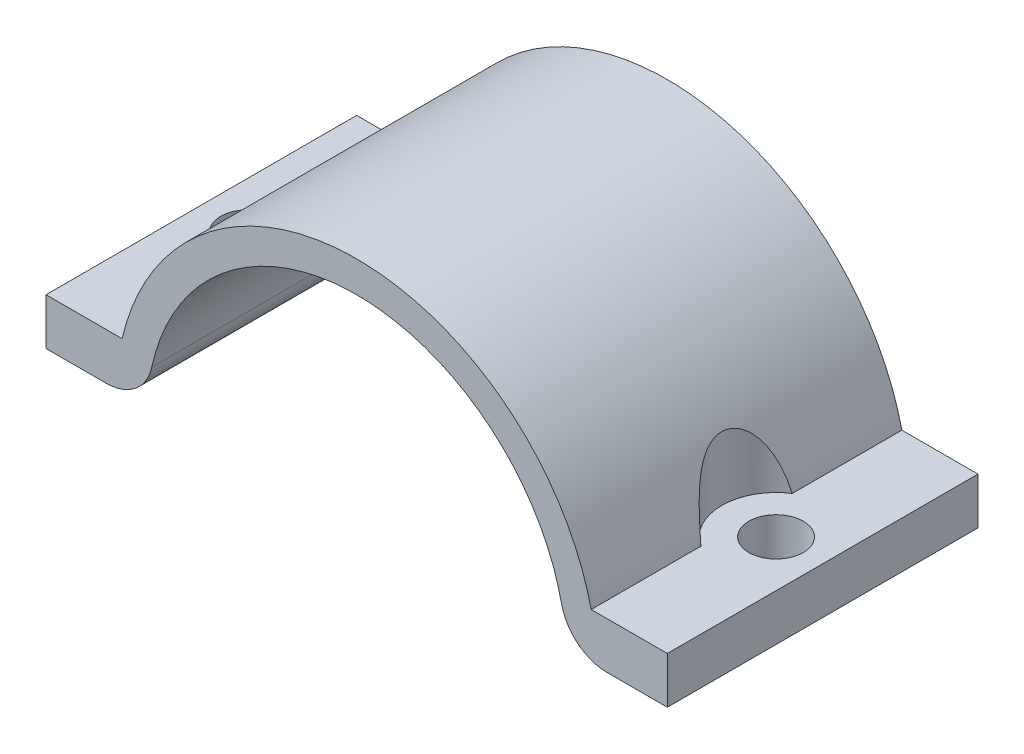
ISO-10303-21;
HEADER;
FILE_DESCRIPTION(('STEP AP214'),'2;1');
FILE_NAME('part.step','',(''),(''),'','','');
FILE_SCHEMA(('AUTOMOTIVE_DESIGN { 1 0 10303 214 1 1 1 1 }'));
ENDSEC;
DATA;
#1=APPLICATION_CONTEXT('core data for automotive mechanical design processes');
#2=APPLICATION_PROTOCOL_DEFINITION('international standard','automotive_design',2000,#1);
#3=PRODUCT_CONTEXT('',#1,'mechanical');
#4=PRODUCT('Part','Part','',(#3));
#5=PRODUCT_RELATED_PRODUCT_CATEGORY('part','',(#4));
#6=PRODUCT_DEFINITION_FORMATION('','',#4);
#7=PRODUCT_DEFINITION_CONTEXT('part definition',#1,'design');
#8=PRODUCT_DEFINITION('design','',#6,#7);
#9=PRODUCT_DEFINITION_SHAPE('','',#8);
#10=(LENGTH_UNIT() NAMED_UNIT(*) SI_UNIT(.MILLI.,.METRE.));
#11=(NAMED_UNIT(*) PLANE_ANGLE_UNIT() SI_UNIT($,.RADIAN.));
#12=(NAMED_UNIT(*) SI_UNIT($,.STERADIAN.) SOLID_ANGLE_UNIT());
#13=UNCERTAINTY_MEASURE_WITH_UNIT(LENGTH_MEASURE(1.E-05),#10,'distance_accuracy_value','');
#14=(GEOMETRIC_REPRESENTATION_CONTEXT(3) GLOBAL_UNCERTAINTY_ASSIGNED_CONTEXT((#13)) GLOBAL_UNIT_ASSIGNED_CONTEXT((#10,
#11,#12)) REPRESENTATION_CONTEXT('',''));
#15=CARTESIAN_POINT('',(0.,0.,0.));
#16=DIRECTION('',(0.,0.,1.));
#17=DIRECTION('',(1.,0.,0.));
#18=AXIS2_PLACEMENT_3D('',#15,#16,#17);
#19=CARTESIAN_POINT('',(0.,0.,20.));
#20=DIRECTION('',(0.,0.,-1.));
#21=DIRECTION('',(-1.,0.,0.));
#22=AXIS2_PLACEMENT_3D('',#19,#20,#21);
#23=CYLINDRICAL_SURFACE('',#22,15.5);
#24=CARTESIAN_POINT('',(-15.0996688705415,3.5,12.9391736250877));
#25=CARTESIAN_POINT('',(-15.0764258915636,3.60027675794691,12.9241412789538));
#26=CARTESIAN_POINT('',(-15.0522169118861,3.70017440010796,12.9081031427626));
#27=CARTESIAN_POINT('',(-15.001912021422,3.899123860995,12.8737738472295));
#28=CARTESIAN_POINT('',(-14.9758157481088,3.99817551310891,12.8554822545482));
#29=CARTESIAN_POINT('',(-14.8945840335699,4.29457866866681,12.7967341796264));
#30=CARTESIAN_POINT('',(-14.8366729703991,4.49045802682144,12.7525086709628));
#31=CARTESIAN_POINT('',(-14.7135084173582,4.87900220209742,12.6511118929452));
#32=CARTESIAN_POINT('',(-14.6481817983461,5.0716087364768,12.5938048143512));
#33=CARTESIAN_POINT('',(-14.5119556650554,5.4491509125207,12.4634405370255));
#34=CARTESIAN_POINT('',(-14.4410661173609,5.63409940521803,12.3904111148731));
#35=CARTESIAN_POINT('',(-14.3376774845322,5.88963014050576,12.2724845998964));
#36=CARTESIAN_POINT('',(-14.3066500616391,5.96457730667212,12.2356969165638));
#37=CARTESIAN_POINT('',(-14.24418601005,6.1122500751113,12.1582321319675));
#38=CARTESIAN_POINT('',(-14.2127493638212,6.18497558174945,12.1175548635813));
#39=CARTESIAN_POINT('',(-14.1182115647601,6.39924474003713,11.9891303295079));
#40=CARTESIAN_POINT('',(-14.0548367635954,6.53699347158558,11.8949400476188));
#41=CARTESIAN_POINT('',(-13.9612707775191,6.73337457358165,11.7377812893744));
#42=CARTESIAN_POINT('',(-13.930109887601,6.79755747560651,11.6822851927792));
#43=CARTESIAN_POINT('',(-13.8690507359242,6.9212860847094,11.5657282054261));
#44=CARTESIAN_POINT('',(-13.8391527035271,6.98083095106514,11.5046663101065));
#45=CARTESIAN_POINT('',(-13.7525756267221,7.15070649999342,11.3129310752585));
#46=CARTESIAN_POINT('',(-13.6986975474611,7.25293222572438,11.1732067425479));
#47=CARTESIAN_POINT('',(-13.6249471902637,7.39014950962004,10.9316307114623));
#48=CARTESIAN_POINT('',(-13.6001199479089,7.43563552611613,10.8372015956651));
#49=CARTESIAN_POINT('',(-13.5577741145964,7.51256804836411,10.6411712883201));
#50=CARTESIAN_POINT('',(-13.5402505425378,7.5440241235619,10.5395750402273));
#51=CARTESIAN_POINT('',(-13.5140724894414,7.59082327300779,10.3308109379533));
#52=CARTESIAN_POINT('',(-13.5054799192811,7.6060538881362,10.2236095316918));
#53=CARTESIAN_POINT('',(-13.4983472316497,7.61870618207459,10.0078326407438));
#54=CARTESIAN_POINT('',(-13.4998031795239,7.61613483152191,9.89925771050323));
#55=CARTESIAN_POINT('',(-13.511971239803,7.59452094626532,9.69478538375495));
#56=CARTESIAN_POINT('',(-13.5217951923935,7.57705870237243,9.59865993235182));
#57=CARTESIAN_POINT('',(-13.5486363063035,7.52895792945502,9.41084504101814));
#58=CARTESIAN_POINT('',(-13.5656563692379,7.49831408526017,9.31915740714263));
#59=CARTESIAN_POINT('',(-13.611948577484,7.41402801822818,9.11375856654472));
#60=CARTESIAN_POINT('',(-13.6433939333572,7.35617558294473,9.00227036580766));
#61=CARTESIAN_POINT('',(-13.7133945859834,7.22484365469421,8.79143376774786));
#62=CARTESIAN_POINT('',(-13.7519628111434,7.15133570831813,8.69210800003242));
#63=CARTESIAN_POINT('',(-13.8530024883701,6.95425269577267,8.46079718280828));
#64=CARTESIAN_POINT('',(-13.9180585108575,6.82358611075425,8.33603399215509));
#65=CARTESIAN_POINT('',(-14.0512889025805,6.54486952116122,8.10992188483541));
#66=CARTESIAN_POINT('',(-14.1194701754935,6.39677977555092,8.00862812500455));
#67=CARTESIAN_POINT('',(-14.246496059584,6.10811470727924,7.83711139168962));
#68=CARTESIAN_POINT('',(-14.3054404337177,5.96892158402544,7.7645858132497));
#69=CARTESIAN_POINT('',(-14.421124501304,5.68373764339327,7.63205860319793));
#70=CARTESIAN_POINT('',(-14.4778623379485,5.53774131885441,7.57206734127232));
#71=CARTESIAN_POINT('',(-14.5881355297386,5.24037392182382,7.46248978239857));
#72=CARTESIAN_POINT('',(-14.6416636900921,5.08899190354209,7.41292627940198));
#73=CARTESIAN_POINT('',(-14.7446669273816,4.78235921140211,7.32265971335684));
#74=CARTESIAN_POINT('',(-14.794143531364,4.62711002413588,7.2819533023623));
#75=CARTESIAN_POINT('',(-14.8894035702965,4.31084492968924,7.20730844527739));
#76=CARTESIAN_POINT('',(-14.9351091051757,4.14977578471931,7.17349805766238));
#77=CARTESIAN_POINT('',(-15.0212799588999,3.82611000258366,7.11255306413007));
#78=CARTESIAN_POINT('',(-15.0617764942601,3.66352939457749,7.08537771966651));
#79=CARTESIAN_POINT('',(-15.0996688705415,3.5,7.06082637491233));
#80=B_SPLINE_CURVE_WITH_KNOTS('',3,(#24,#25,#26,#27,#28,#29,#30,#31,#32,#33,#34,#35,#36,#37,#38,
#39,#40,#41,#42,#43,#44,#45,#46,#47,#48,#49,#50,#51,#52,#53,#54,#55,#56,#57,#58,#59,#60,#61,#62,
#63,#64,#65,#66,#67,#68,#69,#70,#71,#72,#73,#74,#75,#76,#77,#78,#79),.UNSPECIFIED.,.F.,.F.,(4,2,
2,2,2,2,2,2,2,2,2,2,2,2,2,2,2,2,2,2,2,2,2,2,2,2,2,4),(0.,0.312059893675708,0.624179890374114,
1.25065674073641,1.8839598296921,2.51615311497107,2.78325409250176,3.05036655163988,
3.58419899509507,3.85509574211176,4.12604148001421,4.66531629004014,4.98731556001093,
5.30909486580548,5.63309020532067,5.95695868658431,6.25020629599989,6.54357226162394,
6.929861089854,7.31685807045828,7.88969787666931,8.46387059125597,8.96612402486619,
9.46879134354595,9.97254627755743,10.4761104621008,10.9883117102924,11.4972842010358),.UNSPECIFIED.);
#81=CARTESIAN_POINT('',(-15.0996688705415,3.5,12.9391736250877));
#82=VERTEX_POINT('',#81);
#83=CARTESIAN_POINT('',(-15.0996688705415,3.5,7.06082637491233));
#84=VERTEX_POINT('',#83);
#85=EDGE_CURVE('E288',#82,#84,#80,.T.);
#86=ORIENTED_EDGE('',*,*,#85,.F.);
#87=DIRECTION('',(0.,0.,-1.));
#88=VECTOR('',#87,1.);
#89=CARTESIAN_POINT('',(-15.0996688705415,3.5,20.));
#90=LINE('',#89,#88);
#91=CARTESIAN_POINT('',(-15.0996688705415,3.5,20.));
#92=VERTEX_POINT('',#91);
#93=EDGE_CURVE('E155',#92,#82,#90,.T.);
#94=ORIENTED_EDGE('',*,*,#93,.F.);
#95=CARTESIAN_POINT('',(0.,0.,20.));
#96=DIRECTION('',(0.,0.,1.));
#97=DIRECTION('',(1.,0.,0.));
#98=AXIS2_PLACEMENT_3D('',#95,#96,#97);
#99=CIRCLE('',#98,15.5);
#100=CARTESIAN_POINT('',(15.0996688705415,3.5,20.));
#101=VERTEX_POINT('',#100);
#102=EDGE_CURVE('E217',#101,#92,#99,.T.);
#103=ORIENTED_EDGE('',*,*,#102,.F.);
#104=DIRECTION('',(0.,0.,-1.));
#105=VECTOR('',#104,1.);
#106=CARTESIAN_POINT('',(15.0996688705415,3.5,20.));
#107=LINE('',#106,#105);
#108=CARTESIAN_POINT('',(15.0996688705415,3.5,12.9391736250877));
#109=VERTEX_POINT('',#108);
#110=EDGE_CURVE('E149',#101,#109,#107,.T.);
#111=ORIENTED_EDGE('',*,*,#110,.T.);
#112=CARTESIAN_POINT('',(15.0996688705415,3.5,7.06082637491233));
#113=CARTESIAN_POINT('',(15.0764258915636,3.60027675794691,7.07585872104618));
#114=CARTESIAN_POINT('',(15.0522169118861,3.70017440010796,7.09189685723742));
#115=CARTESIAN_POINT('',(15.001912021422,3.899123860995,7.12622615277053));
#116=CARTESIAN_POINT('',(14.9758157481088,3.99817551310891,7.1445177454518));
#117=CARTESIAN_POINT('',(14.8945840335699,4.29457866866681,7.20326582037355));
#118=CARTESIAN_POINT('',(14.8366729703991,4.49045802682144,7.24749132903716));
#119=CARTESIAN_POINT('',(14.7135084173582,4.87900220209742,7.34888810705483));
#120=CARTESIAN_POINT('',(14.6481817983461,5.0716087364768,7.40619518564876));
#121=CARTESIAN_POINT('',(14.5119556650554,5.4491509125207,7.53655946297446));
#122=CARTESIAN_POINT('',(14.4410661173609,5.63409940521803,7.60958888512685));
#123=CARTESIAN_POINT('',(14.3376774845322,5.88963014050576,7.72751540010356));
#124=CARTESIAN_POINT('',(14.3066500616391,5.96457730667212,7.76430308343621));
#125=CARTESIAN_POINT('',(14.24418601005,6.1122500751113,7.84176786803249));
#126=CARTESIAN_POINT('',(14.2127493638212,6.18497558174945,7.88244513641873));
#127=CARTESIAN_POINT('',(14.1182115647601,6.39924474003713,8.01086967049205));
#128=CARTESIAN_POINT('',(14.0548367635954,6.53699347158557,8.10505995238122));
#129=CARTESIAN_POINT('',(13.9612707775191,6.73337457358166,8.26221871062563));
#130=CARTESIAN_POINT('',(13.930109887601,6.79755747560651,8.31771480722082));
#131=CARTESIAN_POINT('',(13.8690507359242,6.9212860847094,8.43427179457387));
#132=CARTESIAN_POINT('',(13.8391527035271,6.98083095106514,8.49533368989349));
#133=CARTESIAN_POINT('',(13.7525756267221,7.15070649999342,8.68706892474147));
#134=CARTESIAN_POINT('',(13.6986975474611,7.25293222572438,8.82679325745208));
#135=CARTESIAN_POINT('',(13.6249471902637,7.39014950962004,9.06836928853771));
#136=CARTESIAN_POINT('',(13.6001199479089,7.43563552611613,9.16279840433493));
#137=CARTESIAN_POINT('',(13.5577741145964,7.51256804836411,9.35882871167985));
#138=CARTESIAN_POINT('',(13.5402505425378,7.5440241235619,9.46042495977274));
#139=CARTESIAN_POINT('',(13.5140724894414,7.59082327300779,9.66918906204674));
#140=CARTESIAN_POINT('',(13.5054799192811,7.6060538881362,9.77639046830819));
#141=CARTESIAN_POINT('',(13.4983472316497,7.61870618207459,9.99216735925623));
#142=CARTESIAN_POINT('',(13.4998031795239,7.61613483152191,10.1007422894968));
#143=CARTESIAN_POINT('',(13.511971239803,7.59452094626532,10.3052146162451));
#144=CARTESIAN_POINT('',(13.5217951923935,7.57705870237243,10.4013400676482));
#145=CARTESIAN_POINT('',(13.5486363063035,7.52895792945502,10.5891549589819));
#146=CARTESIAN_POINT('',(13.5656563692379,7.49831408526017,10.6808425928574));
#147=CARTESIAN_POINT('',(13.611948577484,7.41402801822818,10.8862414334553));
#148=CARTESIAN_POINT('',(13.6433939333572,7.35617558294473,10.9977296341923));
#149=CARTESIAN_POINT('',(13.7133945859834,7.22484365469421,11.2085662322521));
#150=CARTESIAN_POINT('',(13.7519628111434,7.15133570831813,11.3078919999676));
#151=CARTESIAN_POINT('',(13.8530024883701,6.95425269577267,11.5392028171917));
#152=CARTESIAN_POINT('',(13.9180585108575,6.82358611075425,11.6639660078449));
#153=CARTESIAN_POINT('',(14.0512889025805,6.54486952116123,11.8900781151646));
#154=CARTESIAN_POINT('',(14.1194701754935,6.39677977555092,11.9913718749954));
#155=CARTESIAN_POINT('',(14.246496059584,6.10811470727924,12.1628886083104));
#156=CARTESIAN_POINT('',(14.3054404337177,5.96892158402544,12.2354141867503));
#157=CARTESIAN_POINT('',(14.421124501304,5.68373764339327,12.3679413968021));
#158=CARTESIAN_POINT('',(14.4778623379485,5.53774131885442,12.4279326587277));
#159=CARTESIAN_POINT('',(14.5881355297386,5.24037392182382,12.5375102176014));
#160=CARTESIAN_POINT('',(14.6416636900921,5.08899190354209,12.587073720598));
#161=CARTESIAN_POINT('',(14.7446669273816,4.78235921140212,12.6773402866432));
#162=CARTESIAN_POINT('',(14.794143531364,4.62711002413588,12.7180466976377));
#163=CARTESIAN_POINT('',(14.8894035702965,4.31084492968924,12.7926915547226));
#164=CARTESIAN_POINT('',(14.9351091051757,4.14977578471931,12.8265019423376));
#165=CARTESIAN_POINT('',(15.0212799588999,3.82611000258367,12.8874469358699));
#166=CARTESIAN_POINT('',(15.0617764942601,3.66352939457749,12.9146222803335));
#167=CARTESIAN_POINT('',(15.0996688705415,3.5,12.9391736250877));
#168=B_SPLINE_CURVE_WITH_KNOTS('',3,(#112,#113,#114,#115,#116,#117,#118,#119,#120,#121,#122,
#123,#124,#125,#126,#127,#128,#129,#130,#131,#132,#133,#134,#135,#136,#137,#138,#139,#140,#141,
#142,#143,#144,#145,#146,#147,#148,#149,#150,#151,#152,#153,#154,#155,#156,#157,#158,#159,#160,
#161,#162,#163,#164,#165,#166,#167),.UNSPECIFIED.,.F.,.F.,(4,2,2,2,2,2,2,2,2,2,2,2,2,2,2,2,2,2,
2,2,2,2,2,2,2,2,2,4),(0.,0.312059893675708,0.624179890374115,1.25065674073641,1.8839598296921,
2.51615311497107,2.78325409250176,3.05036655163988,3.58419899509506,3.85509574211176,
4.12604148001421,4.66531629004014,4.98731556001093,5.30909486580548,5.63309020532067,
5.95695868658431,6.25020629599989,6.54357226162394,6.929861089854,7.31685807045828,
7.8896978766693,8.46387059125597,8.96612402486619,9.46879134354595,9.97254627755743,
10.4761104621008,10.9883117102924,11.4972842010358),.UNSPECIFIED.);
#169=CARTESIAN_POINT('',(15.0996688705415,3.5,7.06082637491233));
#170=VERTEX_POINT('',#169);
#171=EDGE_CURVE('E11',#170,#109,#168,.T.);
#172=ORIENTED_EDGE('',*,*,#171,.F.);
#173=CARTESIAN_POINT('',(15.0996688705415,3.5,0.));
#174=VERTEX_POINT('',#173);
#175=EDGE_CURVE('E146',#170,#174,#107,.T.);
#176=ORIENTED_EDGE('',*,*,#175,.T.);
#177=CARTESIAN_POINT('',(0.,0.,0.));
#178=DIRECTION('',(0.,0.,1.));
#179=DIRECTION('',(1.,0.,0.));
#180=AXIS2_PLACEMENT_3D('',#177,#178,#179);
#181=CIRCLE('',#180,15.5);
#182=CARTESIAN_POINT('',(-15.0996688705415,3.5,0.));
#183=VERTEX_POINT('',#182);
#184=EDGE_CURVE('E238',#174,#183,#181,.T.);
#185=ORIENTED_EDGE('',*,*,#184,.T.);
#186=EDGE_CURVE('E158',#84,#183,#90,.T.);
#187=ORIENTED_EDGE('',*,*,#186,.F.);
#188=EDGE_LOOP('',(#86,#94,#103,#111,#172,#176,#185,#187));
#189=FACE_BOUND('',#188,.T.);
#190=ADVANCED_FACE('F33',(#189),#23,.T.);
#191=CARTESIAN_POINT('',(16.1245154965971,3.5,20.));
#192=DIRECTION('',(0.,0.,-1.));
#193=DIRECTION('',(-1.,0.,0.));
#194=AXIS2_PLACEMENT_3D('',#191,#192,#193);
#195=CYLINDRICAL_SURFACE('',#194,3.);
#196=DIRECTION('',(0.,0.,-1.));
#197=VECTOR('',#196,1.);
#198=CARTESIAN_POINT('',(16.1245154965971,0.5,20.));
#199=LINE('',#198,#197);
#200=CARTESIAN_POINT('',(16.1245154965971,0.5,8.48473537482677));
#201=VERTEX_POINT('',#200);
#202=CARTESIAN_POINT('',(16.1245154965971,0.5,0.));
#203=VERTEX_POINT('',#202);
#204=EDGE_CURVE('E166',#201,#203,#199,.T.);
#205=ORIENTED_EDGE('',*,*,#204,.F.);
#206=CARTESIAN_POINT('',(16.1245154965971,0.499999999999999,8.48473537482677));
#207=CARTESIAN_POINT('',(16.0826098374102,0.499997342469534,8.50894552553354));
#208=CARTESIAN_POINT('',(16.0417389122426,0.500878363022357,8.53488151559069));
#209=CARTESIAN_POINT('',(15.9623410488955,0.504123805696886,8.59000053920657));
#210=CARTESIAN_POINT('',(15.9238128848886,0.506487444597158,8.61918185166983));
#211=CARTESIAN_POINT('',(15.8123169901109,0.515360280415606,8.71114029608263));
#212=CARTESIAN_POINT('',(15.7431783946967,0.523654869232952,8.77848246726895));
#213=CARTESIAN_POINT('',(15.6171363878611,0.542528192567922,8.9232438496166));
#214=CARTESIAN_POINT('',(15.560216559401,0.553103823481525,9.0006493122914));
#215=CARTESIAN_POINT('',(15.4597391145374,0.574130740805728,9.16377562494809));
#216=CARTESIAN_POINT('',(15.4161878786622,0.584581965559835,9.24950041995063));
#217=CARTESIAN_POINT('',(15.342480223984,0.603463059049959,9.42997825495665));
#218=CARTESIAN_POINT('',(15.3127918439576,0.611818405138199,9.52493127042412));
#219=CARTESIAN_POINT('',(15.26990215895,0.624214122149791,9.71874887056098));
#220=CARTESIAN_POINT('',(15.2566941234711,0.628256254472261,9.81761184139263));
#221=CARTESIAN_POINT('',(15.2474116954916,0.631078602855781,10.0128744212411));
#222=CARTESIAN_POINT('',(15.2507762280315,0.630031146788522,10.1092451107043));
#223=CARTESIAN_POINT('',(15.2732272806795,0.62329327702739,10.2999594744627));
#224=CARTESIAN_POINT('',(15.2923135496302,0.617602937504385,10.3943031811146));
#225=CARTESIAN_POINT('',(15.3451835796762,0.60286775607609,10.5770752022405));
#226=CARTESIAN_POINT('',(15.3787643289335,0.593869494660329,10.6655664271893));
#227=CARTESIAN_POINT('',(15.4596604452818,0.574304882723508,10.8359135417202));
#228=CARTESIAN_POINT('',(15.5069862931179,0.563737338628321,10.917764306742));
#229=CARTESIAN_POINT('',(15.6165298143137,0.542772887523407,11.0761909247092));
#230=CARTESIAN_POINT('',(15.6793012569452,0.532402949802134,11.1523875593811));
#231=CARTESIAN_POINT('',(15.8169245709306,0.515010677466726,11.2932442722681));
#232=CARTESIAN_POINT('',(15.891749347524,0.507980971137685,11.3579295560703));
#233=CARTESIAN_POINT('',(15.9961011648893,0.502647439223267,11.4337431919089));
#234=CARTESIAN_POINT('',(16.0211934767324,0.5016707184816,11.4509884215588));
#235=CARTESIAN_POINT('',(16.0722269408116,0.500347507960851,11.4841358182291));
#236=CARTESIAN_POINT('',(16.0981671373048,0.500000331907538,11.5000394297024));
#237=CARTESIAN_POINT('',(16.1245154965971,0.499999999999999,11.5152646251732));
#238=B_SPLINE_CURVE_WITH_KNOTS('',3,(#206,#207,#208,#209,#210,#211,#212,#213,#214,#215,#216,
#217,#218,#219,#220,#221,#222,#223,#224,#225,#226,#227,#228,#229,#230,#231,#232,#233,#234,#235,
#236,#237),.UNSPECIFIED.,.F.,.F.,(4,2,2,2,2,2,2,2,2,2,2,2,2,2,2,4),(0.,0.145080584111705,
0.290084591108102,0.57920486969629,0.867934222906586,1.15680116664307,1.45481909285449,
1.75271527002426,2.04059670980164,2.32847355071313,2.61244291469866,2.89662937858557,
3.19306019381057,3.4888337278264,3.58018675699506,3.67144014112403),.UNSPECIFIED.);
#239=CARTESIAN_POINT('',(16.1245154965971,0.499999999999999,11.5152646251732));
#240=VERTEX_POINT('',#239);
#241=EDGE_CURVE('E195',#201,#240,#238,.T.);
#242=ORIENTED_EDGE('',*,*,#241,.T.);
#243=CARTESIAN_POINT('',(16.1245154965971,0.5,20.));
#244=VERTEX_POINT('',#243);
#245=EDGE_CURVE('E167',#244,#240,#199,.T.);
#246=ORIENTED_EDGE('',*,*,#245,.F.);
#247=CARTESIAN_POINT('',(16.1245154965971,3.5,20.));
#248=DIRECTION('',(0.,0.,1.));
#249=DIRECTION('',(-1.,0.,0.));
#250=AXIS2_PLACEMENT_3D('',#247,#248,#249);
#251=CIRCLE('',#250,3.);
#252=CARTESIAN_POINT('',(13.1927854063067,2.86363636363636,20.));
#253=VERTEX_POINT('',#252);
#254=EDGE_CURVE('E207',#253,#244,#251,.T.);
#255=ORIENTED_EDGE('',*,*,#254,.F.);
#256=DIRECTION('',(0.,0.,-1.));
#257=VECTOR('',#256,1.);
#258=CARTESIAN_POINT('',(13.1927854063067,2.86363636363636,20.));
#259=LINE('',#258,#257);
#260=CARTESIAN_POINT('',(13.1927854063067,2.86363636363636,0.));
#261=VERTEX_POINT('',#260);
#262=EDGE_CURVE('E229',#253,#261,#259,.T.);
#263=ORIENTED_EDGE('',*,*,#262,.T.);
#264=CARTESIAN_POINT('',(16.1245154965971,3.5,0.));
#265=DIRECTION('',(0.,0.,1.));
#266=DIRECTION('',(-1.,0.,0.));
#267=AXIS2_PLACEMENT_3D('',#264,#265,#266);
#268=CIRCLE('',#267,3.);
#269=EDGE_CURVE('E203',#261,#203,#268,.T.);
#270=ORIENTED_EDGE('',*,*,#269,.T.);
#271=EDGE_LOOP('',(#205,#242,#246,#255,#263,#270));
#272=FACE_BOUND('',#271,.T.);
#273=ADVANCED_FACE('F35',(#272),#195,.T.);
#274=CARTESIAN_POINT('',(16.1245154965971,0.5,20.));
#275=DIRECTION('',(0.,1.,0.));
#276=DIRECTION('',(0.,0.,1.));
#277=AXIS2_PLACEMENT_3D('',#274,#275,#276);
#278=PLANE('',#277);
#279=ORIENTED_EDGE('',*,*,#245,.T.);
#280=CARTESIAN_POINT('',(17.,0.499999999999999,10.));
#281=DIRECTION('',(0.,1.,0.));
#282=DIRECTION('',(0.,0.,1.));
#283=AXIS2_PLACEMENT_3D('',#280,#281,#282);
#284=CIRCLE('',#283,1.75);
#285=EDGE_CURVE('E292',#240,#201,#284,.T.);
#286=ORIENTED_EDGE('',*,*,#285,.T.);
#287=ORIENTED_EDGE('',*,*,#204,.T.);
#288=DIRECTION('',(1.,0.,0.));
#289=VECTOR('',#288,1.);
#290=CARTESIAN_POINT('',(16.1245154965971,0.5,0.));
#291=LINE('',#290,#289);
#292=CARTESIAN_POINT('',(20.,0.5,0.));
#293=VERTEX_POINT('',#292);
#294=EDGE_CURVE('E232',#203,#293,#291,.T.);
#295=ORIENTED_EDGE('',*,*,#294,.T.);
#296=DIRECTION('',(0.,0.,-1.));
#297=VECTOR('',#296,1.);
#298=CARTESIAN_POINT('',(20.,0.5,20.));
#299=LINE('',#298,#297);
#300=CARTESIAN_POINT('',(20.,0.5,20.));
#301=VERTEX_POINT('',#300);
#302=EDGE_CURVE('E163',#301,#293,#299,.T.);
#303=ORIENTED_EDGE('',*,*,#302,.F.);
#304=DIRECTION('',(1.,0.,0.));
#305=VECTOR('',#304,1.);
#306=CARTESIAN_POINT('',(16.1245154965971,0.5,20.));
#307=LINE('',#306,#305);
#308=EDGE_CURVE('E210',#244,#301,#307,.T.);
#309=ORIENTED_EDGE('',*,*,#308,.F.);
#310=EDGE_LOOP('',(#279,#286,#287,#295,#303,#309));
#311=FACE_BOUND('',#310,.T.);
#312=ADVANCED_FACE('F315',(#311),#278,.F.);
#313=CARTESIAN_POINT('',(20.,0.5,20.));
#314=DIRECTION('',(-1.,0.,0.));
#315=DIRECTION('',(0.,0.,1.));
#316=AXIS2_PLACEMENT_3D('',#313,#314,#315);
#317=PLANE('',#316);
#318=DIRECTION('',(0.,1.,0.));
#319=VECTOR('',#318,1.);
#320=CARTESIAN_POINT('',(20.,0.5,0.));
#321=LINE('',#320,#319);
#322=CARTESIAN_POINT('',(20.,3.5,0.));
#323=VERTEX_POINT('',#322);
#324=EDGE_CURVE('E234',#293,#323,#321,.T.);
#325=ORIENTED_EDGE('',*,*,#324,.T.);
#326=DIRECTION('',(0.,0.,-1.));
#327=VECTOR('',#326,1.);
#328=CARTESIAN_POINT('',(20.,3.5,20.));
#329=LINE('',#328,#327);
#330=CARTESIAN_POINT('',(20.,3.5,20.));
#331=VERTEX_POINT('',#330);
#332=EDGE_CURVE('E157',#331,#323,#329,.T.);
#333=ORIENTED_EDGE('',*,*,#332,.F.);
#334=DIRECTION('',(0.,1.,0.));
#335=VECTOR('',#334,1.);
#336=CARTESIAN_POINT('',(20.,0.5,20.));
#337=LINE('',#336,#335);
#338=EDGE_CURVE('E213',#301,#331,#337,.T.);
#339=ORIENTED_EDGE('',*,*,#338,.F.);
#340=ORIENTED_EDGE('',*,*,#302,.T.);
#341=EDGE_LOOP('',(#325,#333,#339,#340));
#342=FACE_BOUND('',#341,.T.);
#343=ADVANCED_FACE('F320',(#342),#317,.F.);
#344=CARTESIAN_POINT('',(20.,3.5,20.));
#345=DIRECTION('',(0.,-1.,0.));
#346=DIRECTION('',(0.,0.,-1.));
#347=AXIS2_PLACEMENT_3D('',#344,#345,#346);
#348=PLANE('',#347);
#349=ORIENTED_EDGE('',*,*,#175,.F.);
#350=CARTESIAN_POINT('',(17.,3.5,10.));
#351=DIRECTION('',(0.,1.,0.));
#352=DIRECTION('',(0.,0.,1.));
#353=AXIS2_PLACEMENT_3D('',#350,#351,#352);
#354=CIRCLE('',#353,3.5);
#355=EDGE_CURVE('E55',#170,#109,#354,.T.);
#356=ORIENTED_EDGE('',*,*,#355,.T.);
#357=ORIENTED_EDGE('',*,*,#110,.F.);
#358=DIRECTION('',(-1.,0.,0.));
#359=VECTOR('',#358,1.);
#360=CARTESIAN_POINT('',(20.,3.5,20.));
#361=LINE('',#360,#359);
#362=EDGE_CURVE('E215',#331,#101,#361,.T.);
#363=ORIENTED_EDGE('',*,*,#362,.F.);
#364=ORIENTED_EDGE('',*,*,#332,.T.);
#365=DIRECTION('',(-1.,0.,0.));
#366=VECTOR('',#365,1.);
#367=CARTESIAN_POINT('',(20.,3.5,0.));
#368=LINE('',#367,#366);
#369=EDGE_CURVE('E153',#323,#174,#368,.T.);
#370=ORIENTED_EDGE('',*,*,#369,.T.);
#371=EDGE_LOOP('',(#349,#356,#357,#363,#364,#370));
#372=FACE_BOUND('',#371,.T.);
#373=CARTESIAN_POINT('',(17.,3.5,10.));
#374=DIRECTION('',(0.,1.,0.));
#375=DIRECTION('',(0.,0.,1.));
#376=AXIS2_PLACEMENT_3D('',#373,#374,#375);
#377=CIRCLE('',#376,1.75);
#378=CARTESIAN_POINT('',(17.,3.5,11.75));
#379=VERTEX_POINT('',#378);
#380=EDGE_CURVE('E205',#379,#379,#377,.T.);
#381=ORIENTED_EDGE('',*,*,#380,.F.);
#382=EDGE_LOOP('',(#381));
#383=FACE_BOUND('',#382,.T.);
#384=ADVANCED_FACE('F150',(#372,#383),#348,.F.);
#385=CARTESIAN_POINT('',(-20.,3.5,20.));
#386=DIRECTION('',(0.,-1.,0.));
#387=DIRECTION('',(0.,0.,-1.));
#388=AXIS2_PLACEMENT_3D('',#385,#386,#387);
#389=PLANE('',#388);
#390=DIRECTION('',(-1.,0.,0.));
#391=VECTOR('',#390,1.);
#392=CARTESIAN_POINT('',(-20.,3.5,0.));
#393=LINE('',#392,#391);
#394=CARTESIAN_POINT('',(-20.,3.5,0.));
#395=VERTEX_POINT('',#394);
#396=EDGE_CURVE('E240',#183,#395,#393,.T.);
#397=ORIENTED_EDGE('',*,*,#396,.T.);
#398=DIRECTION('',(0.,0.,-1.));
#399=VECTOR('',#398,1.);
#400=CARTESIAN_POINT('',(-20.,3.5,20.));
#401=LINE('',#400,#399);
#402=CARTESIAN_POINT('',(-20.,3.5,20.));
#403=VERTEX_POINT('',#402);
#404=EDGE_CURVE('E262',#403,#395,#401,.T.);
#405=ORIENTED_EDGE('',*,*,#404,.F.);
#406=DIRECTION('',(-1.,0.,0.));
#407=VECTOR('',#406,1.);
#408=CARTESIAN_POINT('',(-20.,3.5,20.));
#409=LINE('',#408,#407);
#410=EDGE_CURVE('E219',#92,#403,#409,.T.);
#411=ORIENTED_EDGE('',*,*,#410,.F.);
#412=ORIENTED_EDGE('',*,*,#93,.T.);
#413=CARTESIAN_POINT('',(-17.,3.5,10.));
#414=DIRECTION('',(0.,1.,0.));
#415=DIRECTION('',(0.,0.,1.));
#416=AXIS2_PLACEMENT_3D('',#413,#414,#415);
#417=CIRCLE('',#416,3.5);
#418=EDGE_CURVE('E62',#82,#84,#417,.T.);
#419=ORIENTED_EDGE('',*,*,#418,.T.);
#420=ORIENTED_EDGE('',*,*,#186,.T.);
#421=EDGE_LOOP('',(#397,#405,#411,#412,#419,#420));
#422=FACE_BOUND('',#421,.T.);
#423=CARTESIAN_POINT('',(-17.,3.5,10.));
#424=DIRECTION('',(0.,1.,0.));
#425=DIRECTION('',(0.,0.,1.));
#426=AXIS2_PLACEMENT_3D('',#423,#424,#425);
#427=CIRCLE('',#426,1.75);
#428=CARTESIAN_POINT('',(-17.,3.5,11.75));
#429=VERTEX_POINT('',#428);
#430=EDGE_CURVE('E340',#429,#429,#427,.T.);
#431=ORIENTED_EDGE('',*,*,#430,.F.);
#432=EDGE_LOOP('',(#431));
#433=FACE_BOUND('',#432,.T.);
#434=ADVANCED_FACE('F267',(#422,#433),#389,.F.);
#435=CARTESIAN_POINT('',(-20.,0.5,20.));
#436=DIRECTION('',(1.,0.,0.));
#437=DIRECTION('',(0.,0.,-1.));
#438=AXIS2_PLACEMENT_3D('',#435,#436,#437);
#439=PLANE('',#438);
#440=DIRECTION('',(0.,-1.,0.));
#441=VECTOR('',#440,1.);
#442=CARTESIAN_POINT('',(-20.,0.5,0.));
#443=LINE('',#442,#441);
#444=CARTESIAN_POINT('',(-20.,0.5,0.));
#445=VERTEX_POINT('',#444);
#446=EDGE_CURVE('E243',#395,#445,#443,.T.);
#447=ORIENTED_EDGE('',*,*,#446,.T.);
#448=DIRECTION('',(0.,0.,-1.));
#449=VECTOR('',#448,1.);
#450=CARTESIAN_POINT('',(-20.,0.5,20.));
#451=LINE('',#450,#449);
#452=CARTESIAN_POINT('',(-20.,0.5,20.));
#453=VERTEX_POINT('',#452);
#454=EDGE_CURVE('E260',#453,#445,#451,.T.);
#455=ORIENTED_EDGE('',*,*,#454,.F.);
#456=DIRECTION('',(0.,-1.,0.));
#457=VECTOR('',#456,1.);
#458=CARTESIAN_POINT('',(-20.,0.5,20.));
#459=LINE('',#458,#457);
#460=EDGE_CURVE('E221',#403,#453,#459,.T.);
#461=ORIENTED_EDGE('',*,*,#460,.F.);
#462=ORIENTED_EDGE('',*,*,#404,.T.);
#463=EDGE_LOOP('',(#447,#455,#461,#462));
#464=FACE_BOUND('',#463,.T.);
#465=ADVANCED_FACE('F276',(#464),#439,.F.);
#466=CARTESIAN_POINT('',(-20.,0.5,20.));
#467=DIRECTION('',(0.,1.,0.));
#468=DIRECTION('',(0.,0.,1.));
#469=AXIS2_PLACEMENT_3D('',#466,#467,#468);
#470=PLANE('',#469);
#471=DIRECTION('',(0.,0.,-1.));
#472=VECTOR('',#471,1.);
#473=CARTESIAN_POINT('',(-16.1245154965971,0.5,20.));
#474=LINE('',#473,#472);
#475=CARTESIAN_POINT('',(-16.1245154965971,0.5,8.48473537482677));
#476=VERTEX_POINT('',#475);
#477=CARTESIAN_POINT('',(-16.1245154965971,0.5,0.));
#478=VERTEX_POINT('',#477);
#479=EDGE_CURVE('E256',#476,#478,#474,.T.);
#480=ORIENTED_EDGE('',*,*,#479,.F.);
#481=CARTESIAN_POINT('',(-17.,0.499999999999999,10.));
#482=DIRECTION('',(0.,1.,0.));
#483=DIRECTION('',(0.,0.,1.));
#484=AXIS2_PLACEMENT_3D('',#481,#482,#483);
#485=CIRCLE('',#484,1.75);
#486=CARTESIAN_POINT('',(-16.1245154965971,0.499999999999999,11.5152646251732));
#487=VERTEX_POINT('',#486);
#488=EDGE_CURVE('E204',#476,#487,#485,.T.);
#489=ORIENTED_EDGE('',*,*,#488,.T.);
#490=CARTESIAN_POINT('',(-16.1245154965971,0.5,20.));
#491=VERTEX_POINT('',#490);
#492=EDGE_CURVE('E257',#491,#487,#474,.T.);
#493=ORIENTED_EDGE('',*,*,#492,.F.);
#494=DIRECTION('',(1.,0.,0.));
#495=VECTOR('',#494,1.);
#496=CARTESIAN_POINT('',(-20.,0.5,20.));
#497=LINE('',#496,#495);
#498=EDGE_CURVE('E223',#453,#491,#497,.T.);
#499=ORIENTED_EDGE('',*,*,#498,.F.);
#500=ORIENTED_EDGE('',*,*,#454,.T.);
#501=DIRECTION('',(1.,0.,0.));
#502=VECTOR('',#501,1.);
#503=CARTESIAN_POINT('',(-20.,0.5,0.));
#504=LINE('',#503,#502);
#505=EDGE_CURVE('E245',#445,#478,#504,.T.);
#506=ORIENTED_EDGE('',*,*,#505,.T.);
#507=EDGE_LOOP('',(#480,#489,#493,#499,#500,#506));
#508=FACE_BOUND('',#507,.T.);
#509=ADVANCED_FACE('F280',(#508),#470,.F.);
#510=CARTESIAN_POINT('',(-16.1245154965971,3.5,20.));
#511=DIRECTION('',(0.,0.,-1.));
#512=DIRECTION('',(-1.,0.,0.));
#513=AXIS2_PLACEMENT_3D('',#510,#511,#512);
#514=CYLINDRICAL_SURFACE('',#513,3.);
#515=ORIENTED_EDGE('',*,*,#492,.T.);
#516=CARTESIAN_POINT('',(-16.1245154965971,0.499999999999999,8.48473537482677));
#517=CARTESIAN_POINT('',(-16.2005212933182,0.500000543773819,8.44082066495191));
#518=CARTESIAN_POINT('',(-16.2798472755968,0.502907052110634,8.40264322326084));
#519=CARTESIAN_POINT('',(-16.4428192873345,0.515816381604849,8.33876516435116));
#520=CARTESIAN_POINT('',(-16.5264635766169,0.525816364637183,8.31305956402798));
#521=CARTESIAN_POINT('',(-16.6954220902089,0.553579461509908,8.27453101075564));
#522=CARTESIAN_POINT('',(-16.7807365812517,0.571343825152124,8.26171013290623));
#523=CARTESIAN_POINT('',(-16.9503538086733,0.614578436505174,8.24863549619633));
#524=CARTESIAN_POINT('',(-17.0346563132672,0.640050415828932,8.24838456344432));
#525=CARTESIAN_POINT('',(-17.2006132863757,0.698248714980155,8.25953171567277));
#526=CARTESIAN_POINT('',(-17.282241927448,0.731030144703179,8.27102080700343));
#527=CARTESIAN_POINT('',(-17.4405222695927,0.802650796266783,8.30441908592696));
#528=CARTESIAN_POINT('',(-17.5171714889314,0.841493006475029,8.3263334248395));
#529=CARTESIAN_POINT('',(-17.6940127242677,0.940578608189753,8.38976423279213));
#530=CARTESIAN_POINT('',(-17.7913451170305,1.00316442184692,8.43561596190373));
#531=CARTESIAN_POINT('',(-17.9731564330497,1.13458640542004,8.54171395039083));
#532=CARTESIAN_POINT('',(-18.0576074509716,1.20343564336524,8.60199075396706));
#533=CARTESIAN_POINT('',(-18.2145839775877,1.34525200648789,8.73583925991496));
#534=CARTESIAN_POINT('',(-18.2868999620821,1.41826700926195,8.80960598886031));
#535=CARTESIAN_POINT('',(-18.3850444289312,1.52708155827266,8.92911314377069));
#536=CARTESIAN_POINT('',(-18.4160324878399,1.56322790567114,8.97041587060123));
#537=CARTESIAN_POINT('',(-18.4745359695241,1.63465032140063,9.05610648952893));
#538=CARTESIAN_POINT('',(-18.5020527801655,1.66992673297965,9.10049313754238));
#539=CARTESIAN_POINT('',(-18.558937493437,1.74606315765449,9.20231340806541));
#540=CARTESIAN_POINT('',(-18.5874661435674,1.78652623360764,9.26052102735325));
#541=CARTESIAN_POINT('',(-18.6387356311749,1.86268713786337,9.38241518768816));
#542=CARTESIAN_POINT('',(-18.6614818366181,1.8983893710072,9.44609657327591));
#543=CARTESIAN_POINT('',(-18.6955190893766,1.9537991936979,9.56353740628305));
#544=CARTESIAN_POINT('',(-18.7082490185046,1.97528941209978,9.6160166912112));
#545=CARTESIAN_POINT('',(-18.7290116683517,2.01102967987697,9.7242568073249));
#546=CARTESIAN_POINT('',(-18.7370559500841,2.02529753765922,9.78000918497366));
#547=CARTESIAN_POINT('',(-18.7468744794277,2.04283793805208,9.88486796262391));
#548=CARTESIAN_POINT('',(-18.7494265387185,2.04747061216035,9.93366723135333));
#549=CARTESIAN_POINT('',(-18.7503995472627,2.04922938734133,10.031441950417));
#550=CARTESIAN_POINT('',(-18.7488214793091,2.04635727423149,10.0804173560687));
#551=CARTESIAN_POINT('',(-18.741708381031,2.03359312417372,10.1768787547457));
#552=CARTESIAN_POINT('',(-18.7361911823211,2.02373272320574,10.2243704566138));
#553=CARTESIAN_POINT('',(-18.7216498610865,1.99829852786681,10.3172339496614));
#554=CARTESIAN_POINT('',(-18.7126213629939,1.98271760629177,10.3626030164047));
#555=CARTESIAN_POINT('',(-18.6834736713573,1.93378447186566,10.4845984606959));
#556=CARTESIAN_POINT('',(-18.6601504768717,1.89594815734605,10.558632239457));
#557=CARTESIAN_POINT('',(-18.6058481612869,1.8131498684976,10.6996416233504));
#558=CARTESIAN_POINT('',(-18.5748384723258,1.76815970707425,10.7665874860504));
#559=CARTESIAN_POINT('',(-18.5122450498032,1.68312892035857,10.8826829530677));
#560=CARTESIAN_POINT('',(-18.4817738983046,1.64365941241658,10.9328643919299));
#561=CARTESIAN_POINT('',(-18.4164482101431,1.56358143564087,11.0293559370983));
#562=CARTESIAN_POINT('',(-18.3815912275264,1.52297234116181,11.0756638589863));
#563=CARTESIAN_POINT('',(-18.3075606895515,1.44151949005099,11.164528535418));
#564=CARTESIAN_POINT('',(-18.2683852876607,1.40067564016984,11.2070836711817));
#565=CARTESIAN_POINT('',(-18.1857583735949,1.31948470576407,11.2883479338776));
#566=CARTESIAN_POINT('',(-18.1423046384657,1.27913789187123,11.3270550402202));
#567=CARTESIAN_POINT('',(-18.0039870153365,1.15849591334164,11.4382776310276));
#568=CARTESIAN_POINT('',(-17.9022765136049,1.07986442548153,11.5045444140575));
#569=CARTESIAN_POINT('',(-17.7372159508517,0.96946721730471,11.5883344028546));
#570=CARTESIAN_POINT('',(-17.6801712796745,0.933955583654471,11.6136466305258));
#571=CARTESIAN_POINT('',(-17.5621214917111,0.866007499257017,11.6584641059797));
#572=CARTESIAN_POINT('',(-17.5011189478972,0.833569083730928,11.6779730812232));
#573=CARTESIAN_POINT('',(-17.3562969123124,0.763026563424113,11.7154364891753));
#574=CARTESIAN_POINT('',(-17.2712134679877,0.72623201953508,11.7310829190674));
#575=CARTESIAN_POINT('',(-17.0967745407959,0.660389213451994,11.7495182993137));
#576=CARTESIAN_POINT('',(-17.0074222362841,0.63133529083912,11.7523166694037));
#577=CARTESIAN_POINT('',(-16.826521565683,0.581778542170163,11.7437418893792));
#578=CARTESIAN_POINT('',(-16.7349646931088,0.56131758977039,11.7323003958557));
#579=CARTESIAN_POINT('',(-16.553345224534,0.529376247469434,11.6945782469836));
#580=CARTESIAN_POINT('',(-16.4632824586295,0.51789482950486,11.6682992909636));
#581=CARTESIAN_POINT('',(-16.29468023669,0.503724931825013,11.6039159404054));
#582=CARTESIAN_POINT('',(-16.2157853572882,0.500434032982406,11.5668631272598));
#583=CARTESIAN_POINT('',(-16.064370749179,0.499646698319904,11.481437544037));
#584=CARTESIAN_POINT('',(-15.9918518735814,0.502151036682168,11.4330632623078));
#585=CARTESIAN_POINT('',(-15.8526798284638,0.511498983737676,11.3244655368806));
#586=CARTESIAN_POINT('',(-15.7863046944756,0.518485205859746,11.2638993138602));
#587=CARTESIAN_POINT('',(-15.6637162794384,0.534954191946449,11.1335174152357));
#588=CARTESIAN_POINT('',(-15.6075074774691,0.544438051821998,11.0636976860844));
#589=CARTESIAN_POINT('',(-15.502213037023,0.564722369306902,10.9102169179792));
#590=CARTESIAN_POINT('',(-15.4541060306798,0.575566767285321,10.8258880128329));
#591=CARTESIAN_POINT('',(-15.3724143051076,0.595499931397187,10.6502646963669));
#592=CARTESIAN_POINT('',(-15.338829959775,0.604588652326105,10.5589701057818));
#593=CARTESIAN_POINT('',(-15.2867877974528,0.6192075791867,10.3703019816271));
#594=CARTESIAN_POINT('',(-15.2685766036998,0.624679472201071,10.2728553416942));
#595=CARTESIAN_POINT('',(-15.2488677023982,0.630617964489458,10.0761515955874));
#596=CARTESIAN_POINT('',(-15.2473645580017,0.631086191968904,9.97689508888075));
#597=CARTESIAN_POINT('',(-15.2608285365308,0.627007834767763,9.78372961301351));
#598=CARTESIAN_POINT('',(-15.2751225796081,0.622666169438186,9.68976830065448));
#599=CARTESIAN_POINT('',(-15.3186183879023,0.610184194240319,9.50562036125881));
#600=CARTESIAN_POINT('',(-15.3478237959701,0.602042956177037,9.41543466243372));
#601=CARTESIAN_POINT('',(-15.4207224891694,0.583478128917294,9.24005488052343));
#602=CARTESIAN_POINT('',(-15.4645922804596,0.573027286775958,9.15493726889783));
#603=CARTESIAN_POINT('',(-15.565603396699,0.55207352516941,8.99296600459359));
#604=CARTESIAN_POINT('',(-15.6227470034518,0.541570597054622,8.91611377608286));
#605=CARTESIAN_POINT('',(-15.7484091838012,0.522998815750025,8.77321944559143));
#606=CARTESIAN_POINT('',(-15.8168214848587,0.514909038968125,8.70708683332948));
#607=CARTESIAN_POINT('',(-15.963699039125,0.503410765208471,8.58664066164277));
#608=CARTESIAN_POINT('',(-16.042158123997,0.499999410784636,8.53231990495229));
#609=CARTESIAN_POINT('',(-16.1245154965971,0.499999999999999,8.48473537482677));
#610=B_SPLINE_CURVE_WITH_KNOTS('',3,(#516,#517,#518,#519,#520,#521,#522,#523,#524,#525,#526,
#527,#528,#529,#530,#531,#532,#533,#534,#535,#536,#537,#538,#539,#540,#541,#542,#543,#544,#545,
#546,#547,#548,#549,#550,#551,#552,#553,#554,#555,#556,#557,#558,#559,#560,#561,#562,#563,#564,
#565,#566,#567,#568,#569,#570,#571,#572,#573,#574,#575,#576,#577,#578,#579,#580,#581,#582,#583,
#584,#585,#586,#587,#588,#589,#590,#591,#592,#593,#594,#595,#596,#597,#598,#599,#600,#601,#602,
#603,#604,#605,#606,#607,#608,#609),.UNSPECIFIED.,.T.,.F.,(4,2,2,2,2,2,2,2,2,2,2,2,2,2,2,2,2,2,
2,2,2,2,2,2,2,2,2,2,2,2,2,2,2,2,2,2,2,2,2,2,2,2,2,2,2,2,4),(0.,0.263025881777448,
0.525946585256876,0.788909625643414,1.05193178790687,1.31700842898436,1.58221618589829,
1.95359731371184,2.32577188640027,2.70382729681357,2.89277924760867,3.08165541104431,
3.31047636684759,3.53908412116009,3.71289939346886,3.88628397033252,4.03282972289525,
4.17934060703054,4.32519243834045,4.47122660672507,4.72879803800926,4.98741069910165,
5.19937315106687,5.41145434167296,5.62362657142316,5.83590963019102,6.26687641313567,
6.48196591560413,6.69691696511078,6.97773171557562,7.25834054984286,7.54030135876973,
7.82222988138613,8.08271293338927,8.34323078517127,8.61247963012959,8.8818468132243,
9.17357453586958,9.46530976881228,9.76164072211204,10.0578752456322,10.341958251935,
10.6261106930332,10.9138144415194,11.2015676836835,11.4867481051739,11.7717542689604),.UNSPECIFIED.);
#611=EDGE_CURVE('E48',#487,#476,#610,.T.);
#612=ORIENTED_EDGE('',*,*,#611,.T.);
#613=ORIENTED_EDGE('',*,*,#479,.T.);
#614=CARTESIAN_POINT('',(-16.1245154965971,3.5,0.));
#615=DIRECTION('',(0.,0.,1.));
#616=DIRECTION('',(-1.,0.,0.));
#617=AXIS2_PLACEMENT_3D('',#614,#615,#616);
#618=CIRCLE('',#617,3.);
#619=CARTESIAN_POINT('',(-13.1927854063067,2.86363636363636,0.));
#620=VERTEX_POINT('',#619);
#621=EDGE_CURVE('E248',#478,#620,#618,.T.);
#622=ORIENTED_EDGE('',*,*,#621,.T.);
#623=DIRECTION('',(0.,0.,-1.));
#624=VECTOR('',#623,1.);
#625=CARTESIAN_POINT('',(-13.1927854063067,2.86363636363636,20.));
#626=LINE('',#625,#624);
#627=CARTESIAN_POINT('',(-13.1927854063067,2.86363636363636,20.));
#628=VERTEX_POINT('',#627);
#629=EDGE_CURVE('E253',#628,#620,#626,.T.);
#630=ORIENTED_EDGE('',*,*,#629,.F.);
#631=CARTESIAN_POINT('',(-16.1245154965971,3.5,20.));
#632=DIRECTION('',(0.,0.,1.));
#633=DIRECTION('',(-1.,0.,0.));
#634=AXIS2_PLACEMENT_3D('',#631,#632,#633);
#635=CIRCLE('',#634,3.);
#636=EDGE_CURVE('E225',#491,#628,#635,.T.);
#637=ORIENTED_EDGE('',*,*,#636,.F.);
#638=EDGE_LOOP('',(#515,#612,#613,#622,#630,#637));
#639=FACE_BOUND('',#638,.T.);
#640=ADVANCED_FACE('F175',(#639),#514,.T.);
#641=CARTESIAN_POINT('',(0.,0.,20.));
#642=DIRECTION('',(0.,0.,-1.));
#643=DIRECTION('',(-1.,0.,0.));
#644=AXIS2_PLACEMENT_3D('',#641,#642,#643);
#645=CYLINDRICAL_SURFACE('',#644,13.5);
#646=CARTESIAN_POINT('',(0.,0.,0.));
#647=DIRECTION('',(0.,0.,-1.));
#648=DIRECTION('',(1.,0.,0.));
#649=AXIS2_PLACEMENT_3D('',#646,#647,#648);
#650=CIRCLE('',#649,13.5);
#651=EDGE_CURVE('E211',#620,#261,#650,.T.);
#652=ORIENTED_EDGE('',*,*,#651,.T.);
#653=ORIENTED_EDGE('',*,*,#262,.F.);
#654=CARTESIAN_POINT('',(0.,0.,20.));
#655=DIRECTION('',(0.,0.,-1.));
#656=DIRECTION('',(1.,0.,0.));
#657=AXIS2_PLACEMENT_3D('',#654,#655,#656);
#658=CIRCLE('',#657,13.5);
#659=EDGE_CURVE('E227',#628,#253,#658,.T.);
#660=ORIENTED_EDGE('',*,*,#659,.F.);
#661=ORIENTED_EDGE('',*,*,#629,.T.);
#662=EDGE_LOOP('',(#652,#653,#660,#661));
#663=FACE_BOUND('',#662,.T.);
#664=ADVANCED_FACE('F337',(#663),#645,.F.);
#665=CARTESIAN_POINT('',(16.1245154965971,3.5,20.));
#666=DIRECTION('',(0.,0.,-1.));
#667=DIRECTION('',(-1.,0.,0.));
#668=AXIS2_PLACEMENT_3D('',#665,#666,#667);
#669=PLANE('',#668);
#670=ORIENTED_EDGE('',*,*,#254,.T.);
#671=ORIENTED_EDGE('',*,*,#308,.T.);
#672=ORIENTED_EDGE('',*,*,#338,.T.);
#673=ORIENTED_EDGE('',*,*,#362,.T.);
#674=ORIENTED_EDGE('',*,*,#102,.T.);
#675=ORIENTED_EDGE('',*,*,#410,.T.);
#676=ORIENTED_EDGE('',*,*,#460,.T.);
#677=ORIENTED_EDGE('',*,*,#498,.T.);
#678=ORIENTED_EDGE('',*,*,#636,.T.);
#679=ORIENTED_EDGE('',*,*,#659,.T.);
#680=EDGE_LOOP('',(#670,#671,#672,#673,#674,#675,#676,#677,#678,#679));
#681=FACE_BOUND('',#680,.T.);
#682=ADVANCED_FACE('F192',(#681),#669,.F.);
#683=CARTESIAN_POINT('',(16.1245154965971,3.5,0.));
#684=DIRECTION('',(0.,0.,-1.));
#685=DIRECTION('',(-1.,0.,0.));
#686=AXIS2_PLACEMENT_3D('',#683,#684,#685);
#687=PLANE('',#686);
#688=ORIENTED_EDGE('',*,*,#269,.F.);
#689=ORIENTED_EDGE('',*,*,#651,.F.);
#690=ORIENTED_EDGE('',*,*,#621,.F.);
#691=ORIENTED_EDGE('',*,*,#505,.F.);
#692=ORIENTED_EDGE('',*,*,#446,.F.);
#693=ORIENTED_EDGE('',*,*,#396,.F.);
#694=ORIENTED_EDGE('',*,*,#184,.F.);
#695=ORIENTED_EDGE('',*,*,#369,.F.);
#696=ORIENTED_EDGE('',*,*,#324,.F.);
#697=ORIENTED_EDGE('',*,*,#294,.F.);
#698=EDGE_LOOP('',(#688,#689,#690,#691,#692,#693,#694,#695,#696,#697));
#699=FACE_BOUND('',#698,.T.);
#700=ADVANCED_FACE('F184',(#699),#687,.T.);
#701=CARTESIAN_POINT('',(-17.,0.499999999999999,10.));
#702=DIRECTION('',(0.,1.,0.));
#703=DIRECTION('',(0.,0.,1.));
#704=AXIS2_PLACEMENT_3D('',#701,#702,#703);
#705=CYLINDRICAL_SURFACE('',#704,1.75);
#706=ORIENTED_EDGE('',*,*,#430,.T.);
#707=EDGE_LOOP('',(#706));
#708=FACE_BOUND('',#707,.T.);
#709=ORIENTED_EDGE('',*,*,#488,.F.);
#710=ORIENTED_EDGE('',*,*,#611,.F.);
#711=EDGE_LOOP('',(#709,#710));
#712=FACE_BOUND('',#711,.T.);
#713=ADVANCED_FACE('F179',(#708,#712),#705,.F.);
#714=CARTESIAN_POINT('',(17.,0.499999999999999,10.));
#715=DIRECTION('',(0.,1.,0.));
#716=DIRECTION('',(0.,0.,1.));
#717=AXIS2_PLACEMENT_3D('',#714,#715,#716);
#718=CYLINDRICAL_SURFACE('',#717,1.75);
#719=ORIENTED_EDGE('',*,*,#380,.T.);
#720=EDGE_LOOP('',(#719));
#721=FACE_BOUND('',#720,.T.);
#722=ORIENTED_EDGE('',*,*,#285,.F.);
#723=ORIENTED_EDGE('',*,*,#241,.F.);
#724=EDGE_LOOP('',(#722,#723));
#725=FACE_BOUND('',#724,.T.);
#726=ADVANCED_FACE('F183',(#721,#725),#718,.F.);
#727=CARTESIAN_POINT('',(17.,15.5,10.));
#728=DIRECTION('',(0.,-1.,0.));
#729=DIRECTION('',(0.,0.,-1.));
#730=AXIS2_PLACEMENT_3D('',#727,#728,#729);
#731=CYLINDRICAL_SURFACE('',#730,3.5);
#732=ORIENTED_EDGE('',*,*,#171,.T.);
#733=ORIENTED_EDGE('',*,*,#355,.F.);
#734=EDGE_LOOP('',(#732,#733));
#735=FACE_BOUND('',#734,.T.);
#736=ADVANCED_FACE('F140',(#735),#731,.F.);
#737=CARTESIAN_POINT('',(-17.,15.5,10.));
#738=DIRECTION('',(0.,-1.,0.));
#739=DIRECTION('',(0.,0.,-1.));
#740=AXIS2_PLACEMENT_3D('',#737,#738,#739);
#741=CYLINDRICAL_SURFACE('',#740,3.5);
#742=ORIENTED_EDGE('',*,*,#85,.T.);
#743=ORIENTED_EDGE('',*,*,#418,.F.);
#744=EDGE_LOOP('',(#742,#743));
#745=FACE_BOUND('',#744,.T.);
#746=ADVANCED_FACE('F303',(#745),#741,.F.);
#747=CLOSED_SHELL('',(#190,#273,#312,#343,#384,#434,#465,#509,#640,#664,#682,#700,#713,#726,
#736,#746));
#748=MANIFOLD_SOLID_BREP('B2',#747);
#749=ADVANCED_BREP_SHAPE_REPRESENTATION('',(#18,#748),#14);
#750=SHAPE_DEFINITION_REPRESENTATION(#9,#749);
ENDSEC;
END-ISO-10303-21;
